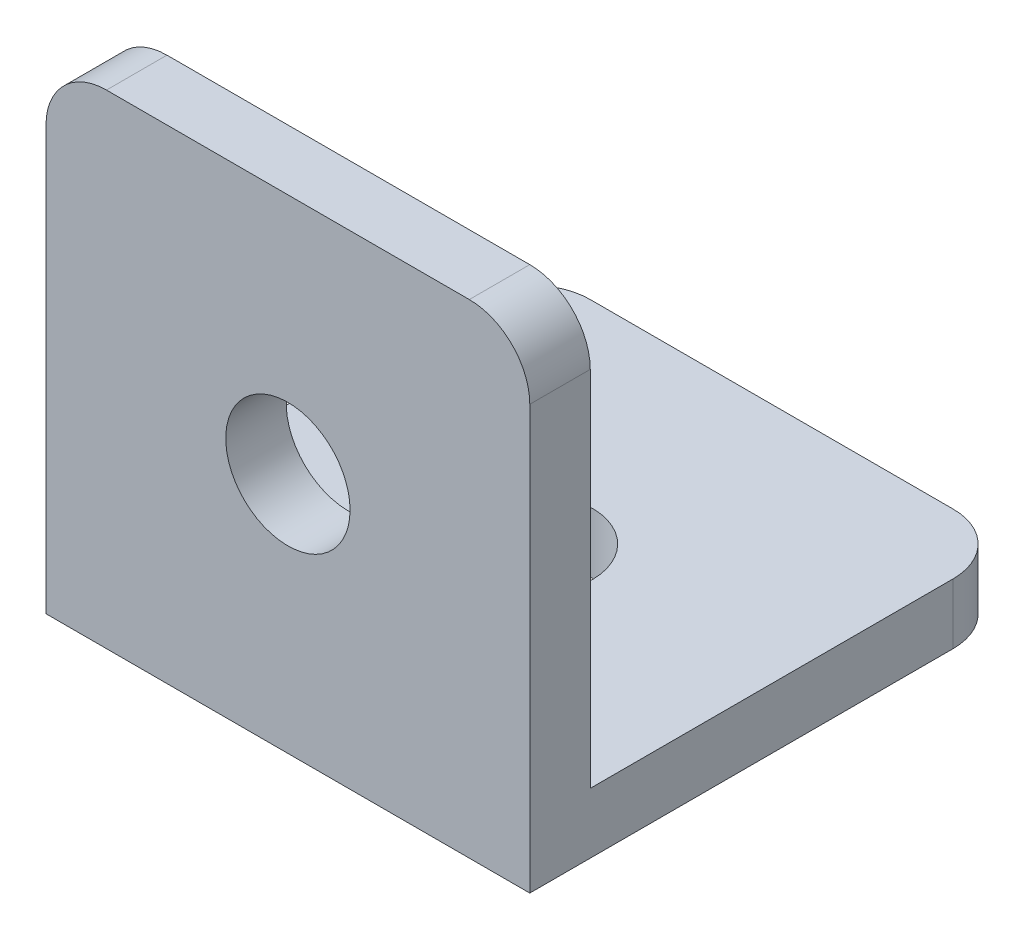
ISO-10303-21;
HEADER;
FILE_DESCRIPTION(('STEP AP214'),'2;1');
FILE_NAME('part.step','',(''),(''),'','','');
FILE_SCHEMA(('AUTOMOTIVE_DESIGN { 1 0 10303 214 1 1 1 1 }'));
ENDSEC;
DATA;
#1=APPLICATION_CONTEXT('core data for automotive mechanical design processes');
#2=APPLICATION_PROTOCOL_DEFINITION('international standard','automotive_design',2000,#1);
#3=PRODUCT_CONTEXT('',#1,'mechanical');
#4=PRODUCT('Part','Part','',(#3));
#5=PRODUCT_RELATED_PRODUCT_CATEGORY('part','',(#4));
#6=PRODUCT_DEFINITION_FORMATION('','',#4);
#7=PRODUCT_DEFINITION_CONTEXT('part definition',#1,'design');
#8=PRODUCT_DEFINITION('design','',#6,#7);
#9=PRODUCT_DEFINITION_SHAPE('','',#8);
#10=(LENGTH_UNIT() NAMED_UNIT(*) SI_UNIT(.MILLI.,.METRE.));
#11=(NAMED_UNIT(*) PLANE_ANGLE_UNIT() SI_UNIT($,.RADIAN.));
#12=(NAMED_UNIT(*) SI_UNIT($,.STERADIAN.) SOLID_ANGLE_UNIT());
#13=UNCERTAINTY_MEASURE_WITH_UNIT(LENGTH_MEASURE(1.E-05),#10,'distance_accuracy_value','');
#14=(GEOMETRIC_REPRESENTATION_CONTEXT(3) GLOBAL_UNCERTAINTY_ASSIGNED_CONTEXT((#13)) GLOBAL_UNIT_ASSIGNED_CONTEXT((#10,
#11,#12)) REPRESENTATION_CONTEXT('',''));
#15=CARTESIAN_POINT('',(0.,0.,0.));
#16=DIRECTION('',(0.,0.,1.));
#17=DIRECTION('',(1.,0.,0.));
#18=AXIS2_PLACEMENT_3D('',#15,#16,#17);
#19=CARTESIAN_POINT('',(0.,3.175,0.));
#20=DIRECTION('',(0.,-1.,0.));
#21=DIRECTION('',(0.,0.,-1.));
#22=AXIS2_PLACEMENT_3D('',#19,#20,#21);
#23=PLANE('',#22);
#24=CARTESIAN_POINT('',(12.7,3.175,-12.7));
#25=DIRECTION('',(0.,1.,0.));
#26=DIRECTION('',(0.,0.,1.));
#27=AXIS2_PLACEMENT_3D('',#24,#25,#26);
#28=CIRCLE('',#27,3.2639);
#29=CARTESIAN_POINT('',(12.7,3.175,-9.4361));
#30=VERTEX_POINT('',#29);
#31=EDGE_CURVE('E159',#30,#30,#28,.T.);
#32=ORIENTED_EDGE('',*,*,#31,.F.);
#33=EDGE_LOOP('',(#32));
#34=FACE_BOUND('',#33,.T.);
#35=DIRECTION('',(0.,0.,-1.));
#36=VECTOR('',#35,1.);
#37=CARTESIAN_POINT('',(25.4,3.175,0.));
#38=LINE('',#37,#36);
#39=CARTESIAN_POINT('',(25.4,3.175,-3.175));
#40=VERTEX_POINT('',#39);
#41=CARTESIAN_POINT('',(25.4,3.175,-22.225));
#42=VERTEX_POINT('',#41);
#43=EDGE_CURVE('E138',#40,#42,#38,.T.);
#44=ORIENTED_EDGE('',*,*,#43,.T.);
#45=CARTESIAN_POINT('',(22.225,3.175,-22.225));
#46=DIRECTION('',(0.,-1.,0.));
#47=DIRECTION('',(0.,0.,-1.));
#48=AXIS2_PLACEMENT_3D('',#45,#46,#47);
#49=CIRCLE('',#48,3.175);
#50=CARTESIAN_POINT('',(22.225,3.175,-25.4));
#51=VERTEX_POINT('',#50);
#52=EDGE_CURVE('E213',#42,#51,#49,.F.);
#53=ORIENTED_EDGE('',*,*,#52,.T.);
#54=DIRECTION('',(-1.,0.,0.));
#55=VECTOR('',#54,1.);
#56=CARTESIAN_POINT('',(0.,3.175,-25.4));
#57=LINE('',#56,#55);
#58=CARTESIAN_POINT('',(3.175,3.175,-25.4));
#59=VERTEX_POINT('',#58);
#60=EDGE_CURVE('E169',#51,#59,#57,.T.);
#61=ORIENTED_EDGE('',*,*,#60,.T.);
#62=CARTESIAN_POINT('',(3.175,3.175,-22.225));
#63=DIRECTION('',(0.,-1.,0.));
#64=DIRECTION('',(0.,0.,-1.));
#65=AXIS2_PLACEMENT_3D('',#62,#63,#64);
#66=CIRCLE('',#65,3.175);
#67=CARTESIAN_POINT('',(0.,3.175,-22.225));
#68=VERTEX_POINT('',#67);
#69=EDGE_CURVE('E136',#59,#68,#66,.F.);
#70=ORIENTED_EDGE('',*,*,#69,.T.);
#71=DIRECTION('',(0.,0.,1.));
#72=VECTOR('',#71,1.);
#73=CARTESIAN_POINT('',(0.,3.175,0.));
#74=LINE('',#73,#72);
#75=CARTESIAN_POINT('',(0.,3.175,-3.175));
#76=VERTEX_POINT('',#75);
#77=EDGE_CURVE('E119',#68,#76,#74,.T.);
#78=ORIENTED_EDGE('',*,*,#77,.T.);
#79=DIRECTION('',(-1.,0.,0.));
#80=VECTOR('',#79,1.);
#81=CARTESIAN_POINT('',(0.,3.175,-3.175));
#82=LINE('',#81,#80);
#83=EDGE_CURVE('E132',#40,#76,#82,.T.);
#84=ORIENTED_EDGE('',*,*,#83,.F.);
#85=EDGE_LOOP('',(#44,#53,#61,#70,#78,#84));
#86=FACE_BOUND('',#85,.T.);
#87=ADVANCED_FACE('F38',(#34,#86),#23,.F.);
#88=CARTESIAN_POINT('',(0.,0.,0.));
#89=DIRECTION('',(0.,-1.,0.));
#90=DIRECTION('',(0.,0.,-1.));
#91=AXIS2_PLACEMENT_3D('',#88,#89,#90);
#92=PLANE('',#91);
#93=DIRECTION('',(-1.,0.,0.));
#94=VECTOR('',#93,1.);
#95=CARTESIAN_POINT('',(0.,0.,-25.4));
#96=LINE('',#95,#94);
#97=CARTESIAN_POINT('',(22.225,0.,-25.4));
#98=VERTEX_POINT('',#97);
#99=CARTESIAN_POINT('',(3.175,0.,-25.4));
#100=VERTEX_POINT('',#99);
#101=EDGE_CURVE('E139',#98,#100,#96,.T.);
#102=ORIENTED_EDGE('',*,*,#101,.F.);
#103=CARTESIAN_POINT('',(22.225,0.,-22.225));
#104=DIRECTION('',(0.,-1.,0.));
#105=DIRECTION('',(0.,0.,-1.));
#106=AXIS2_PLACEMENT_3D('',#103,#104,#105);
#107=CIRCLE('',#106,3.175);
#108=CARTESIAN_POINT('',(25.4,0.,-22.225));
#109=VERTEX_POINT('',#108);
#110=EDGE_CURVE('E202',#98,#109,#107,.T.);
#111=ORIENTED_EDGE('',*,*,#110,.T.);
#112=DIRECTION('',(0.,0.,-1.));
#113=VECTOR('',#112,1.);
#114=CARTESIAN_POINT('',(25.4,0.,0.));
#115=LINE('',#114,#113);
#116=CARTESIAN_POINT('',(25.4,0.,0.));
#117=VERTEX_POINT('',#116);
#118=EDGE_CURVE('E180',#117,#109,#115,.T.);
#119=ORIENTED_EDGE('',*,*,#118,.F.);
#120=DIRECTION('',(1.,0.,0.));
#121=VECTOR('',#120,1.);
#122=CARTESIAN_POINT('',(0.,0.,0.));
#123=LINE('',#122,#121);
#124=CARTESIAN_POINT('',(0.,0.,0.));
#125=VERTEX_POINT('',#124);
#126=EDGE_CURVE('E176',#125,#117,#123,.T.);
#127=ORIENTED_EDGE('',*,*,#126,.F.);
#128=DIRECTION('',(0.,0.,1.));
#129=VECTOR('',#128,1.);
#130=CARTESIAN_POINT('',(0.,0.,0.));
#131=LINE('',#130,#129);
#132=CARTESIAN_POINT('',(0.,0.,-22.225));
#133=VERTEX_POINT('',#132);
#134=EDGE_CURVE('E163',#133,#125,#131,.T.);
#135=ORIENTED_EDGE('',*,*,#134,.F.);
#136=CARTESIAN_POINT('',(3.175,0.,-22.225));
#137=DIRECTION('',(0.,-1.,0.));
#138=DIRECTION('',(0.,0.,-1.));
#139=AXIS2_PLACEMENT_3D('',#136,#137,#138);
#140=CIRCLE('',#139,3.175);
#141=EDGE_CURVE('E199',#133,#100,#140,.T.);
#142=ORIENTED_EDGE('',*,*,#141,.T.);
#143=EDGE_LOOP('',(#102,#111,#119,#127,#135,#142));
#144=FACE_BOUND('',#143,.T.);
#145=CARTESIAN_POINT('',(12.7,0.,-12.7));
#146=DIRECTION('',(0.,1.,0.));
#147=DIRECTION('',(0.,0.,1.));
#148=AXIS2_PLACEMENT_3D('',#145,#146,#147);
#149=CIRCLE('',#148,3.2639);
#150=CARTESIAN_POINT('',(12.7,0.,-9.4361));
#151=VERTEX_POINT('',#150);
#152=EDGE_CURVE('E158',#151,#151,#149,.T.);
#153=ORIENTED_EDGE('',*,*,#152,.T.);
#154=EDGE_LOOP('',(#153));
#155=FACE_BOUND('',#154,.T.);
#156=ADVANCED_FACE('F251',(#144,#155),#92,.T.);
#157=CARTESIAN_POINT('',(0.,3.175,0.));
#158=DIRECTION('',(1.,0.,0.));
#159=DIRECTION('',(0.,0.,-1.));
#160=AXIS2_PLACEMENT_3D('',#157,#158,#159);
#161=PLANE('',#160);
#162=ORIENTED_EDGE('',*,*,#77,.F.);
#163=DIRECTION('',(0.,-1.,0.));
#164=VECTOR('',#163,1.);
#165=CARTESIAN_POINT('',(0.,3.175,-22.225));
#166=LINE('',#165,#164);
#167=EDGE_CURVE('E218',#68,#133,#166,.T.);
#168=ORIENTED_EDGE('',*,*,#167,.T.);
#169=ORIENTED_EDGE('',*,*,#134,.T.);
#170=DIRECTION('',(0.,-1.,0.));
#171=VECTOR('',#170,1.);
#172=CARTESIAN_POINT('',(0.,3.175,0.));
#173=LINE('',#172,#171);
#174=CARTESIAN_POINT('',(0.,22.225,0.));
#175=VERTEX_POINT('',#174);
#176=EDGE_CURVE('E189',#175,#125,#173,.T.);
#177=ORIENTED_EDGE('',*,*,#176,.F.);
#178=DIRECTION('',(0.,0.,1.));
#179=VECTOR('',#178,1.);
#180=CARTESIAN_POINT('',(0.,22.225,0.));
#181=LINE('',#180,#179);
#182=CARTESIAN_POINT('',(0.,22.225,-3.175));
#183=VERTEX_POINT('',#182);
#184=EDGE_CURVE('E123',#175,#183,#181,.F.);
#185=ORIENTED_EDGE('',*,*,#184,.T.);
#186=DIRECTION('',(0.,-1.,0.));
#187=VECTOR('',#186,1.);
#188=CARTESIAN_POINT('',(0.,25.4,-3.175));
#189=LINE('',#188,#187);
#190=EDGE_CURVE('E115',#183,#76,#189,.T.);
#191=ORIENTED_EDGE('',*,*,#190,.T.);
#192=EDGE_LOOP('',(#162,#168,#169,#177,#185,#191));
#193=FACE_BOUND('',#192,.T.);
#194=ADVANCED_FACE('F117',(#193),#161,.F.);
#195=CARTESIAN_POINT('',(0.,3.175,0.));
#196=DIRECTION('',(0.,0.,-1.));
#197=DIRECTION('',(-1.,0.,0.));
#198=AXIS2_PLACEMENT_3D('',#195,#196,#197);
#199=PLANE('',#198);
#200=CARTESIAN_POINT('',(12.7,12.7,0.));
#201=DIRECTION('',(0.,0.,1.));
#202=DIRECTION('',(1.,0.,0.));
#203=AXIS2_PLACEMENT_3D('',#200,#201,#202);
#204=CIRCLE('',#203,3.2639);
#205=CARTESIAN_POINT('',(15.9639,12.7,0.));
#206=VERTEX_POINT('',#205);
#207=EDGE_CURVE('E152',#206,#206,#204,.T.);
#208=ORIENTED_EDGE('',*,*,#207,.F.);
#209=EDGE_LOOP('',(#208));
#210=FACE_BOUND('',#209,.T.);
#211=DIRECTION('',(1.,0.,0.));
#212=VECTOR('',#211,1.);
#213=CARTESIAN_POINT('',(0.,25.4,0.));
#214=LINE('',#213,#212);
#215=CARTESIAN_POINT('',(3.175,25.4,0.));
#216=VERTEX_POINT('',#215);
#217=CARTESIAN_POINT('',(22.225,25.4,0.));
#218=VERTEX_POINT('',#217);
#219=EDGE_CURVE('E144',#216,#218,#214,.T.);
#220=ORIENTED_EDGE('',*,*,#219,.F.);
#221=CARTESIAN_POINT('',(3.175,22.225,0.));
#222=DIRECTION('',(0.,0.,-1.));
#223=DIRECTION('',(-1.,0.,0.));
#224=AXIS2_PLACEMENT_3D('',#221,#222,#223);
#225=CIRCLE('',#224,3.175);
#226=EDGE_CURVE('E231',#216,#175,#225,.F.);
#227=ORIENTED_EDGE('',*,*,#226,.T.);
#228=ORIENTED_EDGE('',*,*,#176,.T.);
#229=ORIENTED_EDGE('',*,*,#126,.T.);
#230=DIRECTION('',(0.,-1.,0.));
#231=VECTOR('',#230,1.);
#232=CARTESIAN_POINT('',(25.4,3.175,0.));
#233=LINE('',#232,#231);
#234=CARTESIAN_POINT('',(25.4,22.225,0.));
#235=VERTEX_POINT('',#234);
#236=EDGE_CURVE('E172',#235,#117,#233,.T.);
#237=ORIENTED_EDGE('',*,*,#236,.F.);
#238=CARTESIAN_POINT('',(22.225,22.225,0.));
#239=DIRECTION('',(0.,0.,-1.));
#240=DIRECTION('',(-1.,0.,0.));
#241=AXIS2_PLACEMENT_3D('',#238,#239,#240);
#242=CIRCLE('',#241,3.175);
#243=EDGE_CURVE('E228',#235,#218,#242,.F.);
#244=ORIENTED_EDGE('',*,*,#243,.T.);
#245=EDGE_LOOP('',(#220,#227,#228,#229,#237,#244));
#246=FACE_BOUND('',#245,.T.);
#247=ADVANCED_FACE('F240',(#210,#246),#199,.F.);
#248=CARTESIAN_POINT('',(25.4,3.175,0.));
#249=DIRECTION('',(-1.,0.,0.));
#250=DIRECTION('',(0.,0.,1.));
#251=AXIS2_PLACEMENT_3D('',#248,#249,#250);
#252=PLANE('',#251);
#253=ORIENTED_EDGE('',*,*,#118,.T.);
#254=DIRECTION('',(0.,-1.,0.));
#255=VECTOR('',#254,1.);
#256=CARTESIAN_POINT('',(25.4,3.175,-22.225));
#257=LINE('',#256,#255);
#258=EDGE_CURVE('E208',#109,#42,#257,.F.);
#259=ORIENTED_EDGE('',*,*,#258,.T.);
#260=ORIENTED_EDGE('',*,*,#43,.F.);
#261=DIRECTION('',(0.,-1.,0.));
#262=VECTOR('',#261,1.);
#263=CARTESIAN_POINT('',(25.4,25.4,-3.175));
#264=LINE('',#263,#262);
#265=CARTESIAN_POINT('',(25.4,22.225,-3.175));
#266=VERTEX_POINT('',#265);
#267=EDGE_CURVE('E126',#266,#40,#264,.T.);
#268=ORIENTED_EDGE('',*,*,#267,.F.);
#269=DIRECTION('',(0.,0.,-1.));
#270=VECTOR('',#269,1.);
#271=CARTESIAN_POINT('',(25.4,22.225,0.));
#272=LINE('',#271,#270);
#273=EDGE_CURVE('E205',#266,#235,#272,.F.);
#274=ORIENTED_EDGE('',*,*,#273,.T.);
#275=ORIENTED_EDGE('',*,*,#236,.T.);
#276=EDGE_LOOP('',(#253,#259,#260,#268,#274,#275));
#277=FACE_BOUND('',#276,.T.);
#278=ADVANCED_FACE('F235',(#277),#252,.F.);
#279=CARTESIAN_POINT('',(0.,3.175,-25.4));
#280=DIRECTION('',(0.,0.,1.));
#281=DIRECTION('',(1.,0.,0.));
#282=AXIS2_PLACEMENT_3D('',#279,#280,#281);
#283=PLANE('',#282);
#284=ORIENTED_EDGE('',*,*,#60,.F.);
#285=DIRECTION('',(0.,-1.,0.));
#286=VECTOR('',#285,1.);
#287=CARTESIAN_POINT('',(22.225,3.175,-25.4));
#288=LINE('',#287,#286);
#289=EDGE_CURVE('E195',#51,#98,#288,.T.);
#290=ORIENTED_EDGE('',*,*,#289,.T.);
#291=ORIENTED_EDGE('',*,*,#101,.T.);
#292=DIRECTION('',(0.,-1.,0.));
#293=VECTOR('',#292,1.);
#294=CARTESIAN_POINT('',(3.175,3.175,-25.4));
#295=LINE('',#294,#293);
#296=EDGE_CURVE('E192',#100,#59,#295,.F.);
#297=ORIENTED_EDGE('',*,*,#296,.T.);
#298=EDGE_LOOP('',(#284,#290,#291,#297));
#299=FACE_BOUND('',#298,.T.);
#300=ADVANCED_FACE('F260',(#299),#283,.F.);
#301=CARTESIAN_POINT('',(12.7,3.175,-12.7));
#302=DIRECTION('',(0.,-1.,0.));
#303=DIRECTION('',(0.,0.,-1.));
#304=AXIS2_PLACEMENT_3D('',#301,#302,#303);
#305=CYLINDRICAL_SURFACE('',#304,3.2639);
#306=ORIENTED_EDGE('',*,*,#31,.T.);
#307=EDGE_LOOP('',(#306));
#308=FACE_BOUND('',#307,.T.);
#309=ORIENTED_EDGE('',*,*,#152,.F.);
#310=EDGE_LOOP('',(#309));
#311=FACE_BOUND('',#310,.T.);
#312=ADVANCED_FACE('F282',(#308,#311),#305,.F.);
#313=CARTESIAN_POINT('',(0.,25.4,-3.175));
#314=DIRECTION('',(0.,0.,1.));
#315=DIRECTION('',(1.,0.,0.));
#316=AXIS2_PLACEMENT_3D('',#313,#314,#315);
#317=PLANE('',#316);
#318=CARTESIAN_POINT('',(12.7,12.7,-3.175));
#319=DIRECTION('',(0.,0.,1.));
#320=DIRECTION('',(1.,0.,0.));
#321=AXIS2_PLACEMENT_3D('',#318,#319,#320);
#322=CIRCLE('',#321,3.2639);
#323=CARTESIAN_POINT('',(15.9639,12.7,-3.175));
#324=VERTEX_POINT('',#323);
#325=EDGE_CURVE('E145',#324,#324,#322,.T.);
#326=ORIENTED_EDGE('',*,*,#325,.T.);
#327=EDGE_LOOP('',(#326));
#328=FACE_BOUND('',#327,.T.);
#329=ORIENTED_EDGE('',*,*,#190,.F.);
#330=CARTESIAN_POINT('',(3.175,22.225,-3.175));
#331=DIRECTION('',(0.,0.,1.));
#332=DIRECTION('',(1.,0.,0.));
#333=AXIS2_PLACEMENT_3D('',#330,#331,#332);
#334=CIRCLE('',#333,3.175);
#335=CARTESIAN_POINT('',(3.175,25.4,-3.175));
#336=VERTEX_POINT('',#335);
#337=EDGE_CURVE('E11',#183,#336,#334,.F.);
#338=ORIENTED_EDGE('',*,*,#337,.T.);
#339=DIRECTION('',(-1.,0.,0.));
#340=VECTOR('',#339,1.);
#341=CARTESIAN_POINT('',(0.,25.4,-3.175));
#342=LINE('',#341,#340);
#343=CARTESIAN_POINT('',(22.225,25.4,-3.175));
#344=VERTEX_POINT('',#343);
#345=EDGE_CURVE('E127',#344,#336,#342,.T.);
#346=ORIENTED_EDGE('',*,*,#345,.F.);
#347=CARTESIAN_POINT('',(22.225,22.225,-3.175));
#348=DIRECTION('',(0.,0.,1.));
#349=DIRECTION('',(1.,0.,0.));
#350=AXIS2_PLACEMENT_3D('',#347,#348,#349);
#351=CIRCLE('',#350,3.175);
#352=EDGE_CURVE('E47',#344,#266,#351,.F.);
#353=ORIENTED_EDGE('',*,*,#352,.T.);
#354=ORIENTED_EDGE('',*,*,#267,.T.);
#355=ORIENTED_EDGE('',*,*,#83,.T.);
#356=EDGE_LOOP('',(#329,#338,#346,#353,#354,#355));
#357=FACE_BOUND('',#356,.T.);
#358=ADVANCED_FACE('F141',(#328,#357),#317,.F.);
#359=CARTESIAN_POINT('',(0.,25.4,0.));
#360=DIRECTION('',(0.,-1.,0.));
#361=DIRECTION('',(0.,0.,-1.));
#362=AXIS2_PLACEMENT_3D('',#359,#360,#361);
#363=PLANE('',#362);
#364=ORIENTED_EDGE('',*,*,#345,.T.);
#365=DIRECTION('',(0.,0.,1.));
#366=VECTOR('',#365,1.);
#367=CARTESIAN_POINT('',(3.175,25.4,0.));
#368=LINE('',#367,#366);
#369=EDGE_CURVE('E224',#336,#216,#368,.T.);
#370=ORIENTED_EDGE('',*,*,#369,.T.);
#371=ORIENTED_EDGE('',*,*,#219,.T.);
#372=DIRECTION('',(0.,0.,-1.));
#373=VECTOR('',#372,1.);
#374=CARTESIAN_POINT('',(22.225,25.4,0.));
#375=LINE('',#374,#373);
#376=EDGE_CURVE('E221',#218,#344,#375,.T.);
#377=ORIENTED_EDGE('',*,*,#376,.T.);
#378=EDGE_LOOP('',(#364,#370,#371,#377));
#379=FACE_BOUND('',#378,.T.);
#380=ADVANCED_FACE('F242',(#379),#363,.F.);
#381=CARTESIAN_POINT('',(12.7,12.7,-3.175));
#382=DIRECTION('',(0.,0.,1.));
#383=DIRECTION('',(1.,0.,0.));
#384=AXIS2_PLACEMENT_3D('',#381,#382,#383);
#385=CYLINDRICAL_SURFACE('',#384,3.2639);
#386=ORIENTED_EDGE('',*,*,#325,.F.);
#387=EDGE_LOOP('',(#386));
#388=FACE_BOUND('',#387,.T.);
#389=ORIENTED_EDGE('',*,*,#207,.T.);
#390=EDGE_LOOP('',(#389));
#391=FACE_BOUND('',#390,.T.);
#392=ADVANCED_FACE('F270',(#388,#391),#385,.F.);
#393=CARTESIAN_POINT('',(22.225,3.175,-22.225));
#394=DIRECTION('',(0.,-1.,0.));
#395=DIRECTION('',(0.,0.,-1.));
#396=AXIS2_PLACEMENT_3D('',#393,#394,#395);
#397=CYLINDRICAL_SURFACE('',#396,3.175);
#398=ORIENTED_EDGE('',*,*,#52,.F.);
#399=ORIENTED_EDGE('',*,*,#258,.F.);
#400=ORIENTED_EDGE('',*,*,#110,.F.);
#401=ORIENTED_EDGE('',*,*,#289,.F.);
#402=EDGE_LOOP('',(#398,#399,#400,#401));
#403=FACE_BOUND('',#402,.T.);
#404=ADVANCED_FACE('F256',(#403),#397,.T.);
#405=CARTESIAN_POINT('',(3.175,3.175,-22.225));
#406=DIRECTION('',(0.,-1.,0.));
#407=DIRECTION('',(0.,0.,-1.));
#408=AXIS2_PLACEMENT_3D('',#405,#406,#407);
#409=CYLINDRICAL_SURFACE('',#408,3.175);
#410=ORIENTED_EDGE('',*,*,#69,.F.);
#411=ORIENTED_EDGE('',*,*,#296,.F.);
#412=ORIENTED_EDGE('',*,*,#141,.F.);
#413=ORIENTED_EDGE('',*,*,#167,.F.);
#414=EDGE_LOOP('',(#410,#411,#412,#413));
#415=FACE_BOUND('',#414,.T.);
#416=ADVANCED_FACE('F263',(#415),#409,.T.);
#417=CARTESIAN_POINT('',(3.175,22.225,0.));
#418=DIRECTION('',(0.,0.,1.));
#419=DIRECTION('',(1.,0.,0.));
#420=AXIS2_PLACEMENT_3D('',#417,#418,#419);
#421=CYLINDRICAL_SURFACE('',#420,3.175);
#422=ORIENTED_EDGE('',*,*,#337,.F.);
#423=ORIENTED_EDGE('',*,*,#184,.F.);
#424=ORIENTED_EDGE('',*,*,#226,.F.);
#425=ORIENTED_EDGE('',*,*,#369,.F.);
#426=EDGE_LOOP('',(#422,#423,#424,#425));
#427=FACE_BOUND('',#426,.T.);
#428=ADVANCED_FACE('F245',(#427),#421,.T.);
#429=CARTESIAN_POINT('',(22.225,22.225,0.));
#430=DIRECTION('',(0.,0.,-1.));
#431=DIRECTION('',(-1.,0.,0.));
#432=AXIS2_PLACEMENT_3D('',#429,#430,#431);
#433=CYLINDRICAL_SURFACE('',#432,3.175);
#434=ORIENTED_EDGE('',*,*,#243,.F.);
#435=ORIENTED_EDGE('',*,*,#273,.F.);
#436=ORIENTED_EDGE('',*,*,#352,.F.);
#437=ORIENTED_EDGE('',*,*,#376,.F.);
#438=EDGE_LOOP('',(#434,#435,#436,#437));
#439=FACE_BOUND('',#438,.T.);
#440=ADVANCED_FACE('F40',(#439),#433,.T.);
#441=CLOSED_SHELL('',(#87,#156,#194,#247,#278,#300,#312,#358,#380,#392,#404,#416,#428,#440));
#442=MANIFOLD_SOLID_BREP('B2',#441);
#443=ADVANCED_BREP_SHAPE_REPRESENTATION('',(#18,#442),#14);
#444=SHAPE_DEFINITION_REPRESENTATION(#9,#443);
ENDSEC;
END-ISO-10303-21;
